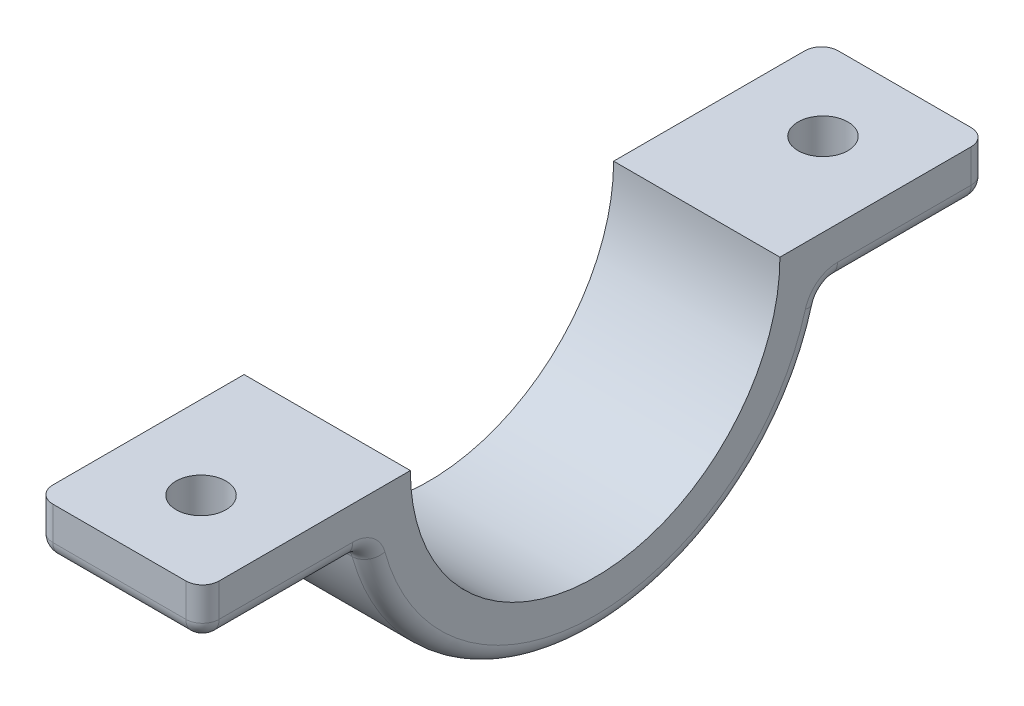
ISO-10303-21;
HEADER;
FILE_DESCRIPTION(('STEP AP214'),'2;1');
FILE_NAME('part.step','',(''),(''),'','','');
FILE_SCHEMA(('AUTOMOTIVE_DESIGN { 1 0 10303 214 1 1 1 1 }'));
ENDSEC;
DATA;
#1=APPLICATION_CONTEXT('core data for automotive mechanical design processes');
#2=APPLICATION_PROTOCOL_DEFINITION('international standard','automotive_design',2000,#1);
#3=PRODUCT_CONTEXT('',#1,'mechanical');
#4=PRODUCT('Part','Part','',(#3));
#5=PRODUCT_RELATED_PRODUCT_CATEGORY('part','',(#4));
#6=PRODUCT_DEFINITION_FORMATION('','',#4);
#7=PRODUCT_DEFINITION_CONTEXT('part definition',#1,'design');
#8=PRODUCT_DEFINITION('design','',#6,#7);
#9=PRODUCT_DEFINITION_SHAPE('','',#8);
#10=(LENGTH_UNIT() NAMED_UNIT(*) SI_UNIT(.MILLI.,.METRE.));
#11=(NAMED_UNIT(*) PLANE_ANGLE_UNIT() SI_UNIT($,.RADIAN.));
#12=(NAMED_UNIT(*) SI_UNIT($,.STERADIAN.) SOLID_ANGLE_UNIT());
#13=UNCERTAINTY_MEASURE_WITH_UNIT(LENGTH_MEASURE(1.E-05),#10,'distance_accuracy_value','');
#14=(GEOMETRIC_REPRESENTATION_CONTEXT(3) GLOBAL_UNCERTAINTY_ASSIGNED_CONTEXT((#13)) GLOBAL_UNIT_ASSIGNED_CONTEXT((#10,
#11,#12)) REPRESENTATION_CONTEXT('',''));
#15=CARTESIAN_POINT('',(0.,0.,0.));
#16=DIRECTION('',(0.,0.,1.));
#17=DIRECTION('',(1.,0.,0.));
#18=AXIS2_PLACEMENT_3D('',#15,#16,#17);
#19=CARTESIAN_POINT('',(10.,0.,0.));
#20=DIRECTION('',(-1.,0.,0.));
#21=DIRECTION('',(0.,0.,1.));
#22=AXIS2_PLACEMENT_3D('',#19,#20,#21);
#23=CYLINDRICAL_SURFACE('',#22,14.1125);
#24=CARTESIAN_POINT('',(0.999999999999999,0.,0.));
#25=DIRECTION('',(1.,0.,0.));
#26=DIRECTION('',(0.,0.,-1.));
#27=AXIS2_PLACEMENT_3D('',#24,#25,#26);
#28=CIRCLE('',#27,14.1125);
#29=CARTESIAN_POINT('',(0.999999999999999,-3.73531844499586,13.6091899966337));
#30=VERTEX_POINT('',#29);
#31=CARTESIAN_POINT('',(0.999999999999999,-3.73531844499586,-13.6091899966337));
#32=VERTEX_POINT('',#31);
#33=EDGE_CURVE('E263',#30,#32,#28,.T.);
#34=ORIENTED_EDGE('',*,*,#33,.T.);
#35=DIRECTION('',(-1.,0.,0.));
#36=VECTOR('',#35,1.);
#37=CARTESIAN_POINT('',(10.,-3.73531844499586,-13.6091899966337));
#38=LINE('',#37,#36);
#39=CARTESIAN_POINT('',(9.,-3.73531844499586,-13.6091899966337));
#40=VERTEX_POINT('',#39);
#41=EDGE_CURVE('E268',#32,#40,#38,.F.);
#42=ORIENTED_EDGE('',*,*,#41,.T.);
#43=CARTESIAN_POINT('',(9.,0.,0.));
#44=DIRECTION('',(1.,0.,0.));
#45=DIRECTION('',(0.,0.,-1.));
#46=AXIS2_PLACEMENT_3D('',#43,#44,#45);
#47=CIRCLE('',#46,14.1125);
#48=CARTESIAN_POINT('',(9.,-3.73531844499586,13.6091899966337));
#49=VERTEX_POINT('',#48);
#50=EDGE_CURVE('E265',#40,#49,#47,.F.);
#51=ORIENTED_EDGE('',*,*,#50,.T.);
#52=DIRECTION('',(-1.,0.,0.));
#53=VECTOR('',#52,1.);
#54=CARTESIAN_POINT('',(10.,-3.73531844499586,13.6091899966337));
#55=LINE('',#54,#53);
#56=EDGE_CURVE('E261',#49,#30,#55,.T.);
#57=ORIENTED_EDGE('',*,*,#56,.T.);
#58=EDGE_LOOP('',(#34,#42,#51,#57));
#59=FACE_BOUND('',#58,.T.);
#60=ADVANCED_FACE('F39',(#59),#23,.T.);
#61=CARTESIAN_POINT('',(10.,-3.,-13.7899476521849));
#62=DIRECTION('',(0.,1.,0.));
#63=DIRECTION('',(0.,0.,1.));
#64=AXIS2_PLACEMENT_3D('',#61,#62,#63);
#65=PLANE('',#64);
#66=DIRECTION('',(0.,0.,-1.));
#67=VECTOR('',#66,1.);
#68=CARTESIAN_POINT('',(0.999999999999999,-3.,-13.7899476521849));
#69=LINE('',#68,#67);
#70=CARTESIAN_POINT('',(0.999999999999999,-3.,-14.5735258688486));
#71=VERTEX_POINT('',#70);
#72=CARTESIAN_POINT('',(0.999999999999999,-3.,-22.6125));
#73=VERTEX_POINT('',#72);
#74=EDGE_CURVE('E238',#71,#73,#69,.T.);
#75=ORIENTED_EDGE('',*,*,#74,.T.);
#76=DIRECTION('',(-1.,0.,0.));
#77=VECTOR('',#76,1.);
#78=CARTESIAN_POINT('',(10.,-3.,-22.6125));
#79=LINE('',#78,#77);
#80=CARTESIAN_POINT('',(9.,-3.,-22.6125));
#81=VERTEX_POINT('',#80);
#82=EDGE_CURVE('E243',#73,#81,#79,.F.);
#83=ORIENTED_EDGE('',*,*,#82,.T.);
#84=DIRECTION('',(0.,0.,-1.));
#85=VECTOR('',#84,1.);
#86=CARTESIAN_POINT('',(9.,-3.,-13.7899476521849));
#87=LINE('',#86,#85);
#88=CARTESIAN_POINT('',(9.,-3.,-14.5735258688486));
#89=VERTEX_POINT('',#88);
#90=EDGE_CURVE('E240',#81,#89,#87,.F.);
#91=ORIENTED_EDGE('',*,*,#90,.T.);
#92=DIRECTION('',(1.,0.,0.));
#93=VECTOR('',#92,1.);
#94=CARTESIAN_POINT('',(0.,-3.,-14.5735258688486));
#95=LINE('',#94,#93);
#96=EDGE_CURVE('E236',#89,#71,#95,.F.);
#97=ORIENTED_EDGE('',*,*,#96,.T.);
#98=EDGE_LOOP('',(#75,#83,#91,#97));
#99=FACE_BOUND('',#98,.T.);
#100=CARTESIAN_POINT('',(5.,-3.,-18.7012238260924));
#101=DIRECTION('',(0.,-1.,0.));
#102=DIRECTION('',(0.,0.,-1.));
#103=AXIS2_PLACEMENT_3D('',#100,#101,#102);
#104=CIRCLE('',#103,1.5);
#105=CARTESIAN_POINT('',(5.,-3.,-20.2012238260924));
#106=VERTEX_POINT('',#105);
#107=EDGE_CURVE('E361',#106,#106,#104,.F.);
#108=ORIENTED_EDGE('',*,*,#107,.T.);
#109=EDGE_LOOP('',(#108));
#110=FACE_BOUND('',#109,.T.);
#111=ADVANCED_FACE('F402',(#99,#110),#65,.F.);
#112=CARTESIAN_POINT('',(10.,0.,-23.6125));
#113=DIRECTION('',(0.,0.,1.));
#114=DIRECTION('',(1.,0.,0.));
#115=AXIS2_PLACEMENT_3D('',#112,#113,#114);
#116=PLANE('',#115);
#117=DIRECTION('',(-1.,0.,0.));
#118=VECTOR('',#117,1.);
#119=CARTESIAN_POINT('',(10.,0.,-23.6125));
#120=LINE('',#119,#118);
#121=CARTESIAN_POINT('',(9.,0.,-23.6125));
#122=VERTEX_POINT('',#121);
#123=CARTESIAN_POINT('',(0.999999999999999,0.,-23.6125));
#124=VERTEX_POINT('',#123);
#125=EDGE_CURVE('E199',#122,#124,#120,.T.);
#126=ORIENTED_EDGE('',*,*,#125,.F.);
#127=DIRECTION('',(0.,1.,0.));
#128=VECTOR('',#127,1.);
#129=CARTESIAN_POINT('',(9.,-3.,-23.6125));
#130=LINE('',#129,#128);
#131=CARTESIAN_POINT('',(9.,-2.,-23.6125));
#132=VERTEX_POINT('',#131);
#133=EDGE_CURVE('E288',#122,#132,#130,.F.);
#134=ORIENTED_EDGE('',*,*,#133,.T.);
#135=DIRECTION('',(-1.,0.,0.));
#136=VECTOR('',#135,1.);
#137=CARTESIAN_POINT('',(10.,-2.,-23.6125));
#138=LINE('',#137,#136);
#139=CARTESIAN_POINT('',(0.999999999999999,-2.,-23.6125));
#140=VERTEX_POINT('',#139);
#141=EDGE_CURVE('E284',#132,#140,#138,.T.);
#142=ORIENTED_EDGE('',*,*,#141,.T.);
#143=DIRECTION('',(0.,1.,0.));
#144=VECTOR('',#143,1.);
#145=CARTESIAN_POINT('',(0.999999999999999,0.,-23.6125));
#146=LINE('',#145,#144);
#147=EDGE_CURVE('E286',#140,#124,#146,.T.);
#148=ORIENTED_EDGE('',*,*,#147,.T.);
#149=EDGE_LOOP('',(#126,#134,#142,#148));
#150=FACE_BOUND('',#149,.T.);
#151=ADVANCED_FACE('F408',(#150),#116,.F.);
#152=CARTESIAN_POINT('',(10.,0.,-11.1125));
#153=DIRECTION('',(0.,-1.,0.));
#154=DIRECTION('',(0.,0.,-1.));
#155=AXIS2_PLACEMENT_3D('',#152,#153,#154);
#156=PLANE('',#155);
#157=CARTESIAN_POINT('',(5.,0.,-18.7012238260924));
#158=DIRECTION('',(0.,-1.,0.));
#159=DIRECTION('',(0.,0.,-1.));
#160=AXIS2_PLACEMENT_3D('',#157,#158,#159);
#161=CIRCLE('',#160,1.5);
#162=CARTESIAN_POINT('',(5.,0.,-20.2012238260924));
#163=VERTEX_POINT('',#162);
#164=EDGE_CURVE('E366',#163,#163,#161,.F.);
#165=ORIENTED_EDGE('',*,*,#164,.F.);
#166=EDGE_LOOP('',(#165));
#167=FACE_BOUND('',#166,.T.);
#168=DIRECTION('',(0.,0.,1.));
#169=VECTOR('',#168,1.);
#170=CARTESIAN_POINT('',(10.,0.,-11.1125));
#171=LINE('',#170,#169);
#172=CARTESIAN_POINT('',(10.,0.,-22.6125));
#173=VERTEX_POINT('',#172);
#174=CARTESIAN_POINT('',(10.,0.,-11.1125));
#175=VERTEX_POINT('',#174);
#176=EDGE_CURVE('E178',#173,#175,#171,.T.);
#177=ORIENTED_EDGE('',*,*,#176,.F.);
#178=CARTESIAN_POINT('',(9.,0.,-22.6125));
#179=DIRECTION('',(0.,-1.,0.));
#180=DIRECTION('',(0.,0.,-1.));
#181=AXIS2_PLACEMENT_3D('',#178,#179,#180);
#182=CIRCLE('',#181,1.);
#183=EDGE_CURVE('E282',#173,#122,#182,.F.);
#184=ORIENTED_EDGE('',*,*,#183,.T.);
#185=ORIENTED_EDGE('',*,*,#125,.T.);
#186=CARTESIAN_POINT('',(0.999999999999999,0.,-22.6125));
#187=DIRECTION('',(0.,-1.,0.));
#188=DIRECTION('',(0.,0.,-1.));
#189=AXIS2_PLACEMENT_3D('',#186,#187,#188);
#190=CIRCLE('',#189,1.);
#191=CARTESIAN_POINT('',(0.,0.,-22.6125));
#192=VERTEX_POINT('',#191);
#193=EDGE_CURVE('E280',#124,#192,#190,.F.);
#194=ORIENTED_EDGE('',*,*,#193,.T.);
#195=DIRECTION('',(0.,0.,1.));
#196=VECTOR('',#195,1.);
#197=CARTESIAN_POINT('',(0.,0.,-11.1125));
#198=LINE('',#197,#196);
#199=CARTESIAN_POINT('',(0.,0.,-11.1125));
#200=VERTEX_POINT('',#199);
#201=EDGE_CURVE('E196',#192,#200,#198,.T.);
#202=ORIENTED_EDGE('',*,*,#201,.T.);
#203=DIRECTION('',(-1.,0.,0.));
#204=VECTOR('',#203,1.);
#205=CARTESIAN_POINT('',(10.,0.,-11.1125));
#206=LINE('',#205,#204);
#207=EDGE_CURVE('E193',#175,#200,#206,.T.);
#208=ORIENTED_EDGE('',*,*,#207,.F.);
#209=EDGE_LOOP('',(#177,#184,#185,#194,#202,#208));
#210=FACE_BOUND('',#209,.T.);
#211=ADVANCED_FACE('F194',(#167,#210),#156,.F.);
#212=CARTESIAN_POINT('',(10.,0.,0.));
#213=DIRECTION('',(-1.,0.,0.));
#214=DIRECTION('',(0.,0.,1.));
#215=AXIS2_PLACEMENT_3D('',#212,#213,#214);
#216=CYLINDRICAL_SURFACE('',#215,11.1125);
#217=CARTESIAN_POINT('',(0.,0.,0.));
#218=DIRECTION('',(-1.,0.,0.));
#219=DIRECTION('',(0.,0.,-1.));
#220=AXIS2_PLACEMENT_3D('',#217,#218,#219);
#221=CIRCLE('',#220,11.1125);
#222=CARTESIAN_POINT('',(0.,0.,11.1125));
#223=VERTEX_POINT('',#222);
#224=EDGE_CURVE('E212',#200,#223,#221,.T.);
#225=ORIENTED_EDGE('',*,*,#224,.T.);
#226=DIRECTION('',(-1.,0.,0.));
#227=VECTOR('',#226,1.);
#228=CARTESIAN_POINT('',(10.,0.,11.1125));
#229=LINE('',#228,#227);
#230=CARTESIAN_POINT('',(10.,0.,11.1125));
#231=VERTEX_POINT('',#230);
#232=EDGE_CURVE('E200',#231,#223,#229,.T.);
#233=ORIENTED_EDGE('',*,*,#232,.F.);
#234=CARTESIAN_POINT('',(10.,0.,0.));
#235=DIRECTION('',(-1.,0.,0.));
#236=DIRECTION('',(0.,0.,-1.));
#237=AXIS2_PLACEMENT_3D('',#234,#235,#236);
#238=CIRCLE('',#237,11.1125);
#239=EDGE_CURVE('E184',#175,#231,#238,.T.);
#240=ORIENTED_EDGE('',*,*,#239,.F.);
#241=ORIENTED_EDGE('',*,*,#207,.T.);
#242=EDGE_LOOP('',(#225,#233,#240,#241));
#243=FACE_BOUND('',#242,.T.);
#244=ADVANCED_FACE('F202',(#243),#216,.F.);
#245=CARTESIAN_POINT('',(10.,0.,23.6125));
#246=DIRECTION('',(0.,-1.,0.));
#247=DIRECTION('',(0.,0.,-1.));
#248=AXIS2_PLACEMENT_3D('',#245,#246,#247);
#249=PLANE('',#248);
#250=CARTESIAN_POINT('',(5.,0.,18.7012238260924));
#251=DIRECTION('',(0.,-1.,0.));
#252=DIRECTION('',(0.,0.,-1.));
#253=AXIS2_PLACEMENT_3D('',#250,#251,#252);
#254=CIRCLE('',#253,1.5);
#255=CARTESIAN_POINT('',(5.,0.,17.2012238260924));
#256=VERTEX_POINT('',#255);
#257=EDGE_CURVE('E213',#256,#256,#254,.T.);
#258=ORIENTED_EDGE('',*,*,#257,.T.);
#259=EDGE_LOOP('',(#258));
#260=FACE_BOUND('',#259,.T.);
#261=DIRECTION('',(0.,0.,1.));
#262=VECTOR('',#261,1.);
#263=CARTESIAN_POINT('',(0.,0.,23.6125));
#264=LINE('',#263,#262);
#265=CARTESIAN_POINT('',(0.,0.,22.6125));
#266=VERTEX_POINT('',#265);
#267=EDGE_CURVE('E190',#223,#266,#264,.T.);
#268=ORIENTED_EDGE('',*,*,#267,.T.);
#269=CARTESIAN_POINT('',(0.999999999999999,0.,22.6125));
#270=DIRECTION('',(0.,-1.,0.));
#271=DIRECTION('',(0.,0.,-1.));
#272=AXIS2_PLACEMENT_3D('',#269,#270,#271);
#273=CIRCLE('',#272,1.);
#274=CARTESIAN_POINT('',(0.999999999999999,0.,23.6125));
#275=VERTEX_POINT('',#274);
#276=EDGE_CURVE('E278',#266,#275,#273,.F.);
#277=ORIENTED_EDGE('',*,*,#276,.T.);
#278=DIRECTION('',(-1.,0.,0.));
#279=VECTOR('',#278,1.);
#280=CARTESIAN_POINT('',(10.,0.,23.6125));
#281=LINE('',#280,#279);
#282=CARTESIAN_POINT('',(9.,0.,23.6125));
#283=VERTEX_POINT('',#282);
#284=EDGE_CURVE('E207',#283,#275,#281,.T.);
#285=ORIENTED_EDGE('',*,*,#284,.F.);
#286=CARTESIAN_POINT('',(9.,0.,22.6125));
#287=DIRECTION('',(0.,-1.,0.));
#288=DIRECTION('',(0.,0.,-1.));
#289=AXIS2_PLACEMENT_3D('',#286,#287,#288);
#290=CIRCLE('',#289,1.);
#291=CARTESIAN_POINT('',(10.,0.,22.6125));
#292=VERTEX_POINT('',#291);
#293=EDGE_CURVE('E276',#283,#292,#290,.F.);
#294=ORIENTED_EDGE('',*,*,#293,.T.);
#295=DIRECTION('',(0.,0.,1.));
#296=VECTOR('',#295,1.);
#297=CARTESIAN_POINT('',(10.,0.,23.6125));
#298=LINE('',#297,#296);
#299=EDGE_CURVE('E205',#231,#292,#298,.T.);
#300=ORIENTED_EDGE('',*,*,#299,.F.);
#301=ORIENTED_EDGE('',*,*,#232,.T.);
#302=EDGE_LOOP('',(#268,#277,#285,#294,#300,#301));
#303=FACE_BOUND('',#302,.T.);
#304=ADVANCED_FACE('F378',(#260,#303),#249,.F.);
#305=CARTESIAN_POINT('',(10.,0.,23.6125));
#306=DIRECTION('',(0.,0.,-1.));
#307=DIRECTION('',(-1.,0.,0.));
#308=AXIS2_PLACEMENT_3D('',#305,#306,#307);
#309=PLANE('',#308);
#310=ORIENTED_EDGE('',*,*,#284,.T.);
#311=DIRECTION('',(0.,-1.,0.));
#312=VECTOR('',#311,1.);
#313=CARTESIAN_POINT('',(0.999999999999999,0.,23.6125));
#314=LINE('',#313,#312);
#315=CARTESIAN_POINT('',(0.999999999999999,-2.,23.6125));
#316=VERTEX_POINT('',#315);
#317=EDGE_CURVE('E274',#275,#316,#314,.T.);
#318=ORIENTED_EDGE('',*,*,#317,.T.);
#319=DIRECTION('',(-1.,0.,0.));
#320=VECTOR('',#319,1.);
#321=CARTESIAN_POINT('',(10.,-2.,23.6125));
#322=LINE('',#321,#320);
#323=CARTESIAN_POINT('',(9.,-2.,23.6125));
#324=VERTEX_POINT('',#323);
#325=EDGE_CURVE('E270',#316,#324,#322,.F.);
#326=ORIENTED_EDGE('',*,*,#325,.T.);
#327=DIRECTION('',(0.,-1.,0.));
#328=VECTOR('',#327,1.);
#329=CARTESIAN_POINT('',(9.,0.,23.6125));
#330=LINE('',#329,#328);
#331=EDGE_CURVE('E272',#324,#283,#330,.F.);
#332=ORIENTED_EDGE('',*,*,#331,.T.);
#333=EDGE_LOOP('',(#310,#318,#326,#332));
#334=FACE_BOUND('',#333,.T.);
#335=ADVANCED_FACE('F391',(#334),#309,.F.);
#336=CARTESIAN_POINT('',(10.,-3.,23.6125));
#337=DIRECTION('',(0.,1.,0.));
#338=DIRECTION('',(0.,0.,1.));
#339=AXIS2_PLACEMENT_3D('',#336,#337,#338);
#340=PLANE('',#339);
#341=DIRECTION('',(0.,0.,-1.));
#342=VECTOR('',#341,1.);
#343=CARTESIAN_POINT('',(0.999999999999999,-3.,23.6125));
#344=LINE('',#343,#342);
#345=CARTESIAN_POINT('',(0.999999999999999,-3.,22.6125));
#346=VERTEX_POINT('',#345);
#347=CARTESIAN_POINT('',(0.999999999999999,-3.,14.5735258688486));
#348=VERTEX_POINT('',#347);
#349=EDGE_CURVE('E290',#346,#348,#344,.T.);
#350=ORIENTED_EDGE('',*,*,#349,.T.);
#351=DIRECTION('',(1.,0.,0.));
#352=VECTOR('',#351,1.);
#353=CARTESIAN_POINT('',(10.,-3.,14.5735258688486));
#354=LINE('',#353,#352);
#355=CARTESIAN_POINT('',(9.,-3.,14.5735258688486));
#356=VERTEX_POINT('',#355);
#357=EDGE_CURVE('E11',#348,#356,#354,.T.);
#358=ORIENTED_EDGE('',*,*,#357,.T.);
#359=DIRECTION('',(0.,0.,-1.));
#360=VECTOR('',#359,1.);
#361=CARTESIAN_POINT('',(9.,-3.,23.6125));
#362=LINE('',#361,#360);
#363=CARTESIAN_POINT('',(9.,-3.,22.6125));
#364=VERTEX_POINT('',#363);
#365=EDGE_CURVE('E48',#356,#364,#362,.F.);
#366=ORIENTED_EDGE('',*,*,#365,.T.);
#367=DIRECTION('',(-1.,0.,0.));
#368=VECTOR('',#367,1.);
#369=CARTESIAN_POINT('',(10.,-3.,22.6125));
#370=LINE('',#369,#368);
#371=EDGE_CURVE('E292',#364,#346,#370,.T.);
#372=ORIENTED_EDGE('',*,*,#371,.T.);
#373=EDGE_LOOP('',(#350,#358,#366,#372));
#374=FACE_BOUND('',#373,.T.);
#375=CARTESIAN_POINT('',(5.,-3.,18.7012238260924));
#376=DIRECTION('',(0.,-1.,0.));
#377=DIRECTION('',(0.,0.,-1.));
#378=AXIS2_PLACEMENT_3D('',#375,#376,#377);
#379=CIRCLE('',#378,1.5);
#380=CARTESIAN_POINT('',(5.,-3.,17.2012238260924));
#381=VERTEX_POINT('',#380);
#382=EDGE_CURVE('E370',#381,#381,#379,.T.);
#383=ORIENTED_EDGE('',*,*,#382,.F.);
#384=EDGE_LOOP('',(#383));
#385=FACE_BOUND('',#384,.T.);
#386=ADVANCED_FACE('F389',(#374,#385),#340,.F.);
#387=CARTESIAN_POINT('',(10.,0.,0.));
#388=DIRECTION('',(1.,0.,0.));
#389=DIRECTION('',(0.,0.,-1.));
#390=AXIS2_PLACEMENT_3D('',#387,#388,#389);
#391=PLANE('',#390);
#392=DIRECTION('',(0.,0.,-1.));
#393=VECTOR('',#392,1.);
#394=CARTESIAN_POINT('',(10.,-2.,-23.6125));
#395=LINE('',#394,#393);
#396=CARTESIAN_POINT('',(10.,-2.,-14.5735258688486));
#397=VERTEX_POINT('',#396);
#398=CARTESIAN_POINT('',(10.,-2.,-22.6125));
#399=VERTEX_POINT('',#398);
#400=EDGE_CURVE('E233',#397,#399,#395,.T.);
#401=ORIENTED_EDGE('',*,*,#400,.T.);
#402=DIRECTION('',(0.,1.,0.));
#403=VECTOR('',#402,1.);
#404=CARTESIAN_POINT('',(10.,0.,-22.6125));
#405=LINE('',#404,#403);
#406=EDGE_CURVE('E187',#399,#173,#405,.T.);
#407=ORIENTED_EDGE('',*,*,#406,.T.);
#408=ORIENTED_EDGE('',*,*,#176,.T.);
#409=ORIENTED_EDGE('',*,*,#239,.T.);
#410=ORIENTED_EDGE('',*,*,#299,.T.);
#411=DIRECTION('',(0.,-1.,0.));
#412=VECTOR('',#411,1.);
#413=CARTESIAN_POINT('',(10.,-3.,22.6125));
#414=LINE('',#413,#412);
#415=CARTESIAN_POINT('',(10.,-2.,22.6125));
#416=VERTEX_POINT('',#415);
#417=EDGE_CURVE('E226',#292,#416,#414,.T.);
#418=ORIENTED_EDGE('',*,*,#417,.T.);
#419=DIRECTION('',(0.,0.,-1.));
#420=VECTOR('',#419,1.);
#421=CARTESIAN_POINT('',(10.,-2.,13.7899476521849));
#422=LINE('',#421,#420);
#423=CARTESIAN_POINT('',(10.,-2.,14.5735258688486));
#424=VERTEX_POINT('',#423);
#425=EDGE_CURVE('E224',#416,#424,#422,.T.);
#426=ORIENTED_EDGE('',*,*,#425,.T.);
#427=CARTESIAN_POINT('',(10.,-4.,14.5735258688486));
#428=DIRECTION('',(1.,0.,0.));
#429=DIRECTION('',(0.,0.,-1.));
#430=AXIS2_PLACEMENT_3D('',#427,#428,#429);
#431=CIRCLE('',#430,2.);
#432=CARTESIAN_POINT('',(10.,-3.47063688999173,12.6448541244187));
#433=VERTEX_POINT('',#432);
#434=EDGE_CURVE('E222',#433,#424,#431,.T.);
#435=ORIENTED_EDGE('',*,*,#434,.F.);
#436=CARTESIAN_POINT('',(10.,0.,0.));
#437=DIRECTION('',(1.,0.,0.));
#438=DIRECTION('',(0.,0.,-1.));
#439=AXIS2_PLACEMENT_3D('',#436,#437,#438);
#440=CIRCLE('',#439,13.1125);
#441=CARTESIAN_POINT('',(10.,-3.47063688999173,-12.6448541244187));
#442=VERTEX_POINT('',#441);
#443=EDGE_CURVE('E228',#433,#442,#440,.T.);
#444=ORIENTED_EDGE('',*,*,#443,.T.);
#445=CARTESIAN_POINT('',(10.,-4.,-14.5735258688486));
#446=DIRECTION('',(1.,0.,0.));
#447=DIRECTION('',(0.,0.,-1.));
#448=AXIS2_PLACEMENT_3D('',#445,#446,#447);
#449=CIRCLE('',#448,2.);
#450=EDGE_CURVE('E230',#397,#442,#449,.T.);
#451=ORIENTED_EDGE('',*,*,#450,.F.);
#452=EDGE_LOOP('',(#401,#407,#408,#409,#410,#418,#426,#435,#444,#451));
#453=FACE_BOUND('',#452,.T.);
#454=ADVANCED_FACE('F181',(#453),#391,.T.);
#455=CARTESIAN_POINT('',(0.,0.,0.));
#456=DIRECTION('',(1.,0.,0.));
#457=DIRECTION('',(0.,0.,-1.));
#458=AXIS2_PLACEMENT_3D('',#455,#456,#457);
#459=PLANE('',#458);
#460=ORIENTED_EDGE('',*,*,#201,.F.);
#461=DIRECTION('',(0.,1.,0.));
#462=VECTOR('',#461,1.);
#463=CARTESIAN_POINT('',(0.,0.,-22.6125));
#464=LINE('',#463,#462);
#465=CARTESIAN_POINT('',(0.,-2.,-22.6125));
#466=VERTEX_POINT('',#465);
#467=EDGE_CURVE('E259',#192,#466,#464,.F.);
#468=ORIENTED_EDGE('',*,*,#467,.T.);
#469=DIRECTION('',(0.,0.,-1.));
#470=VECTOR('',#469,1.);
#471=CARTESIAN_POINT('',(0.,-2.,0.));
#472=LINE('',#471,#470);
#473=CARTESIAN_POINT('',(0.,-2.,-14.5735258688486));
#474=VERTEX_POINT('',#473);
#475=EDGE_CURVE('E257',#466,#474,#472,.F.);
#476=ORIENTED_EDGE('',*,*,#475,.T.);
#477=CARTESIAN_POINT('',(0.,-4.,-14.5735258688486));
#478=DIRECTION('',(1.,0.,0.));
#479=DIRECTION('',(0.,0.,-1.));
#480=AXIS2_PLACEMENT_3D('',#477,#478,#479);
#481=CIRCLE('',#480,2.);
#482=CARTESIAN_POINT('',(0.,-3.47063688999173,-12.6448541244187));
#483=VERTEX_POINT('',#482);
#484=EDGE_CURVE('E254',#483,#474,#481,.F.);
#485=ORIENTED_EDGE('',*,*,#484,.F.);
#486=CARTESIAN_POINT('',(0.,0.,0.));
#487=DIRECTION('',(1.,0.,0.));
#488=DIRECTION('',(0.,0.,-1.));
#489=AXIS2_PLACEMENT_3D('',#486,#487,#488);
#490=CIRCLE('',#489,13.1125);
#491=CARTESIAN_POINT('',(0.,-3.47063688999173,12.6448541244187));
#492=VERTEX_POINT('',#491);
#493=EDGE_CURVE('E252',#483,#492,#490,.F.);
#494=ORIENTED_EDGE('',*,*,#493,.T.);
#495=CARTESIAN_POINT('',(0.,-4.,14.5735258688486));
#496=DIRECTION('',(1.,0.,0.));
#497=DIRECTION('',(0.,0.,-1.));
#498=AXIS2_PLACEMENT_3D('',#495,#496,#497);
#499=CIRCLE('',#498,2.);
#500=CARTESIAN_POINT('',(0.,-2.,14.5735258688486));
#501=VERTEX_POINT('',#500);
#502=EDGE_CURVE('E249',#501,#492,#499,.F.);
#503=ORIENTED_EDGE('',*,*,#502,.F.);
#504=DIRECTION('',(0.,0.,-1.));
#505=VECTOR('',#504,1.);
#506=CARTESIAN_POINT('',(0.,-2.,0.));
#507=LINE('',#506,#505);
#508=CARTESIAN_POINT('',(0.,-2.,22.6125));
#509=VERTEX_POINT('',#508);
#510=EDGE_CURVE('E245',#501,#509,#507,.F.);
#511=ORIENTED_EDGE('',*,*,#510,.T.);
#512=DIRECTION('',(0.,-1.,0.));
#513=VECTOR('',#512,1.);
#514=CARTESIAN_POINT('',(0.,0.,22.6125));
#515=LINE('',#514,#513);
#516=EDGE_CURVE('E247',#509,#266,#515,.F.);
#517=ORIENTED_EDGE('',*,*,#516,.T.);
#518=ORIENTED_EDGE('',*,*,#267,.F.);
#519=ORIENTED_EDGE('',*,*,#224,.F.);
#520=EDGE_LOOP('',(#460,#468,#476,#485,#494,#503,#511,#517,#518,#519));
#521=FACE_BOUND('',#520,.T.);
#522=ADVANCED_FACE('F385',(#521),#459,.F.);
#523=CARTESIAN_POINT('',(5.,0.,18.7012238260924));
#524=DIRECTION('',(0.,-1.,0.));
#525=DIRECTION('',(0.,0.,-1.));
#526=AXIS2_PLACEMENT_3D('',#523,#524,#525);
#527=CYLINDRICAL_SURFACE('',#526,1.5);
#528=ORIENTED_EDGE('',*,*,#257,.F.);
#529=EDGE_LOOP('',(#528));
#530=FACE_BOUND('',#529,.T.);
#531=ORIENTED_EDGE('',*,*,#382,.T.);
#532=EDGE_LOOP('',(#531));
#533=FACE_BOUND('',#532,.T.);
#534=ADVANCED_FACE('F381',(#530,#533),#527,.F.);
#535=CARTESIAN_POINT('',(5.,0.,-18.7012238260924));
#536=DIRECTION('',(0.,-1.,0.));
#537=DIRECTION('',(0.,0.,-1.));
#538=AXIS2_PLACEMENT_3D('',#535,#536,#537);
#539=CYLINDRICAL_SURFACE('',#538,1.5);
#540=ORIENTED_EDGE('',*,*,#164,.T.);
#541=EDGE_LOOP('',(#540));
#542=FACE_BOUND('',#541,.T.);
#543=ORIENTED_EDGE('',*,*,#107,.F.);
#544=EDGE_LOOP('',(#543));
#545=FACE_BOUND('',#544,.T.);
#546=ADVANCED_FACE('F384',(#542,#545),#539,.F.);
#547=CARTESIAN_POINT('',(0.999999999999999,0.,22.6125));
#548=DIRECTION('',(0.,-1.,0.));
#549=DIRECTION('',(0.,0.,-1.));
#550=AXIS2_PLACEMENT_3D('',#547,#548,#549);
#551=CYLINDRICAL_SURFACE('',#550,1.);
#552=CARTESIAN_POINT('',(0.999999999999999,-2.,22.6125));
#553=DIRECTION('',(0.,-1.,0.));
#554=DIRECTION('',(0.,0.,-1.));
#555=AXIS2_PLACEMENT_3D('',#552,#553,#554);
#556=CIRCLE('',#555,1.);
#557=EDGE_CURVE('E43',#316,#509,#556,.T.);
#558=ORIENTED_EDGE('',*,*,#557,.F.);
#559=ORIENTED_EDGE('',*,*,#317,.F.);
#560=ORIENTED_EDGE('',*,*,#276,.F.);
#561=ORIENTED_EDGE('',*,*,#516,.F.);
#562=EDGE_LOOP('',(#558,#559,#560,#561));
#563=FACE_BOUND('',#562,.T.);
#564=ADVANCED_FACE('F41',(#563),#551,.T.);
#565=CARTESIAN_POINT('',(1.,-2.,22.6125));
#566=DIRECTION('',(-1.,0.,0.));
#567=DIRECTION('',(0.,0.,1.));
#568=AXIS2_PLACEMENT_3D('',#565,#566,#567);
#569=SPHERICAL_SURFACE('',#568,1.);
#570=CARTESIAN_POINT('',(0.999999999999999,-2.,22.6125));
#571=DIRECTION('',(-1.,0.,0.));
#572=DIRECTION('',(0.,0.,1.));
#573=AXIS2_PLACEMENT_3D('',#570,#571,#572);
#574=CIRCLE('',#573,1.);
#575=EDGE_CURVE('E352',#316,#346,#574,.F.);
#576=ORIENTED_EDGE('',*,*,#575,.F.);
#577=ORIENTED_EDGE('',*,*,#557,.T.);
#578=CARTESIAN_POINT('',(1.,-2.,22.6125));
#579=DIRECTION('',(0.,0.,1.));
#580=DIRECTION('',(1.,0.,0.));
#581=AXIS2_PLACEMENT_3D('',#578,#579,#580);
#582=CIRCLE('',#581,1.);
#583=EDGE_CURVE('E354',#346,#509,#582,.F.);
#584=ORIENTED_EDGE('',*,*,#583,.F.);
#585=EDGE_LOOP('',(#576,#577,#584));
#586=FACE_BOUND('',#585,.T.);
#587=ADVANCED_FACE('F490',(#586),#569,.T.);
#588=CARTESIAN_POINT('',(0.999999999999999,-2.,23.6125));
#589=DIRECTION('',(0.,0.,-1.));
#590=DIRECTION('',(0.,1.,0.));
#591=AXIS2_PLACEMENT_3D('',#588,#589,#590);
#592=CYLINDRICAL_SURFACE('',#591,1.);
#593=ORIENTED_EDGE('',*,*,#583,.T.);
#594=ORIENTED_EDGE('',*,*,#510,.F.);
#595=CARTESIAN_POINT('',(0.999999999999999,-2.,14.5735258688486));
#596=DIRECTION('',(0.,0.,-1.));
#597=DIRECTION('',(-1.,0.,0.));
#598=AXIS2_PLACEMENT_3D('',#595,#596,#597);
#599=CIRCLE('',#598,1.);
#600=EDGE_CURVE('E349',#348,#501,#599,.T.);
#601=ORIENTED_EDGE('',*,*,#600,.F.);
#602=ORIENTED_EDGE('',*,*,#349,.F.);
#603=EDGE_LOOP('',(#593,#594,#601,#602));
#604=FACE_BOUND('',#603,.T.);
#605=ADVANCED_FACE('F487',(#604),#592,.T.);
#606=CARTESIAN_POINT('',(10.,-2.,22.6125));
#607=DIRECTION('',(-1.,0.,0.));
#608=DIRECTION('',(0.,0.,1.));
#609=AXIS2_PLACEMENT_3D('',#606,#607,#608);
#610=CYLINDRICAL_SURFACE('',#609,1.);
#611=ORIENTED_EDGE('',*,*,#575,.T.);
#612=ORIENTED_EDGE('',*,*,#371,.F.);
#613=CARTESIAN_POINT('',(9.,-2.,22.6125));
#614=DIRECTION('',(1.,0.,0.));
#615=DIRECTION('',(0.,0.,-1.));
#616=AXIS2_PLACEMENT_3D('',#613,#614,#615);
#617=CIRCLE('',#616,1.);
#618=EDGE_CURVE('E346',#324,#364,#617,.T.);
#619=ORIENTED_EDGE('',*,*,#618,.F.);
#620=ORIENTED_EDGE('',*,*,#325,.F.);
#621=EDGE_LOOP('',(#611,#612,#619,#620));
#622=FACE_BOUND('',#621,.T.);
#623=ADVANCED_FACE('F483',(#622),#610,.T.);
#624=CARTESIAN_POINT('',(9.,0.,22.6125));
#625=DIRECTION('',(0.,1.,0.));
#626=DIRECTION('',(0.,0.,1.));
#627=AXIS2_PLACEMENT_3D('',#624,#625,#626);
#628=CYLINDRICAL_SURFACE('',#627,1.);
#629=ORIENTED_EDGE('',*,*,#293,.F.);
#630=ORIENTED_EDGE('',*,*,#331,.F.);
#631=CARTESIAN_POINT('',(9.,-2.,22.6125));
#632=DIRECTION('',(0.,-1.,0.));
#633=DIRECTION('',(0.,0.,-1.));
#634=AXIS2_PLACEMENT_3D('',#631,#632,#633);
#635=CIRCLE('',#634,1.);
#636=EDGE_CURVE('E343',#416,#324,#635,.T.);
#637=ORIENTED_EDGE('',*,*,#636,.F.);
#638=ORIENTED_EDGE('',*,*,#417,.F.);
#639=EDGE_LOOP('',(#629,#630,#637,#638));
#640=FACE_BOUND('',#639,.T.);
#641=ADVANCED_FACE('F479',(#640),#628,.T.);
#642=CARTESIAN_POINT('',(0.999999999999999,-4.,14.5735258688486));
#643=DIRECTION('',(1.,0.,0.));
#644=DIRECTION('',(0.,0.,-1.));
#645=AXIS2_PLACEMENT_3D('',#642,#643,#644);
#646=TOROIDAL_SURFACE('',#645,2.,1.);
#647=ORIENTED_EDGE('',*,*,#600,.T.);
#648=ORIENTED_EDGE('',*,*,#502,.T.);
#649=CARTESIAN_POINT('',(1.,-3.47063688999173,12.6448541244187));
#650=DIRECTION('',(0.,0.964335872214963,0.264681555004136));
#651=DIRECTION('',(0.,-0.264681555004136,0.964335872214963));
#652=AXIS2_PLACEMENT_3D('',#649,#650,#651);
#653=CIRCLE('',#652,1.);
#654=EDGE_CURVE('E340',#30,#492,#653,.F.);
#655=ORIENTED_EDGE('',*,*,#654,.F.);
#656=CARTESIAN_POINT('',(0.999999999999999,-4.,14.5735258688486));
#657=DIRECTION('',(1.,0.,0.));
#658=DIRECTION('',(0.,0.,-1.));
#659=AXIS2_PLACEMENT_3D('',#656,#657,#658);
#660=CIRCLE('',#659,1.);
#661=EDGE_CURVE('E337',#348,#30,#660,.F.);
#662=ORIENTED_EDGE('',*,*,#661,.F.);
#663=EDGE_LOOP('',(#647,#648,#655,#662));
#664=FACE_BOUND('',#663,.T.);
#665=ADVANCED_FACE('F475',(#664),#646,.T.);
#666=CARTESIAN_POINT('',(9.,-2.,22.6125));
#667=DIRECTION('',(0.,0.,1.));
#668=DIRECTION('',(1.,0.,0.));
#669=AXIS2_PLACEMENT_3D('',#666,#667,#668);
#670=SPHERICAL_SURFACE('',#669,1.);
#671=ORIENTED_EDGE('',*,*,#636,.T.);
#672=ORIENTED_EDGE('',*,*,#618,.T.);
#673=CARTESIAN_POINT('',(9.,-2.,22.6125));
#674=DIRECTION('',(0.,0.,1.));
#675=DIRECTION('',(1.,0.,0.));
#676=AXIS2_PLACEMENT_3D('',#673,#674,#675);
#677=CIRCLE('',#676,1.);
#678=EDGE_CURVE('E334',#416,#364,#677,.F.);
#679=ORIENTED_EDGE('',*,*,#678,.F.);
#680=EDGE_LOOP('',(#671,#672,#679));
#681=FACE_BOUND('',#680,.T.);
#682=ADVANCED_FACE('F471',(#681),#670,.T.);
#683=CARTESIAN_POINT('',(0.999999999999999,0.,0.));
#684=DIRECTION('',(1.,0.,0.));
#685=DIRECTION('',(0.,0.,-1.));
#686=AXIS2_PLACEMENT_3D('',#683,#684,#685);
#687=TOROIDAL_SURFACE('',#686,13.1125,1.);
#688=ORIENTED_EDGE('',*,*,#654,.T.);
#689=ORIENTED_EDGE('',*,*,#493,.F.);
#690=CARTESIAN_POINT('',(0.999999999999999,-3.47063688999173,-12.6448541244187));
#691=DIRECTION('',(0.,0.964335872214962,-0.264681555004136));
#692=DIRECTION('',(0.,0.264681555004136,0.964335872214963));
#693=AXIS2_PLACEMENT_3D('',#690,#691,#692);
#694=CIRCLE('',#693,1.);
#695=EDGE_CURVE('E328',#32,#483,#694,.T.);
#696=ORIENTED_EDGE('',*,*,#695,.F.);
#697=ORIENTED_EDGE('',*,*,#33,.F.);
#698=EDGE_LOOP('',(#688,#689,#696,#697));
#699=FACE_BOUND('',#698,.T.);
#700=ADVANCED_FACE('F467',(#699),#687,.T.);
#701=CARTESIAN_POINT('',(10.,-4.,14.5735258688486));
#702=DIRECTION('',(-1.,0.,0.));
#703=DIRECTION('',(0.,0.,1.));
#704=AXIS2_PLACEMENT_3D('',#701,#702,#703);
#705=CYLINDRICAL_SURFACE('',#704,1.);
#706=ORIENTED_EDGE('',*,*,#661,.T.);
#707=ORIENTED_EDGE('',*,*,#56,.F.);
#708=CARTESIAN_POINT('',(9.,-4.,14.5735258688486));
#709=DIRECTION('',(1.,0.,0.));
#710=DIRECTION('',(0.,0.,-1.));
#711=AXIS2_PLACEMENT_3D('',#708,#709,#710);
#712=CIRCLE('',#711,1.);
#713=EDGE_CURVE('E326',#356,#49,#712,.F.);
#714=ORIENTED_EDGE('',*,*,#713,.F.);
#715=ORIENTED_EDGE('',*,*,#357,.F.);
#716=EDGE_LOOP('',(#706,#707,#714,#715));
#717=FACE_BOUND('',#716,.T.);
#718=ADVANCED_FACE('F463',(#717),#705,.F.);
#719=CARTESIAN_POINT('',(9.,-2.,0.));
#720=DIRECTION('',(0.,0.,1.));
#721=DIRECTION('',(0.,-1.,0.));
#722=AXIS2_PLACEMENT_3D('',#719,#720,#721);
#723=CYLINDRICAL_SURFACE('',#722,1.);
#724=ORIENTED_EDGE('',*,*,#678,.T.);
#725=ORIENTED_EDGE('',*,*,#365,.F.);
#726=CARTESIAN_POINT('',(9.,-2.,14.5735258688486));
#727=DIRECTION('',(0.,0.,-1.));
#728=DIRECTION('',(-1.,0.,0.));
#729=AXIS2_PLACEMENT_3D('',#726,#727,#728);
#730=CIRCLE('',#729,1.);
#731=EDGE_CURVE('E56',#424,#356,#730,.T.);
#732=ORIENTED_EDGE('',*,*,#731,.F.);
#733=ORIENTED_EDGE('',*,*,#425,.F.);
#734=EDGE_LOOP('',(#724,#725,#732,#733));
#735=FACE_BOUND('',#734,.T.);
#736=ADVANCED_FACE('F459',(#735),#723,.T.);
#737=CARTESIAN_POINT('',(0.999999999999999,0.,-22.6125));
#738=DIRECTION('',(0.,1.,0.));
#739=DIRECTION('',(0.,0.,1.));
#740=AXIS2_PLACEMENT_3D('',#737,#738,#739);
#741=CYLINDRICAL_SURFACE('',#740,1.);
#742=ORIENTED_EDGE('',*,*,#193,.F.);
#743=ORIENTED_EDGE('',*,*,#147,.F.);
#744=CARTESIAN_POINT('',(1.,-2.,-22.6125));
#745=DIRECTION('',(0.,-1.,0.));
#746=DIRECTION('',(0.,0.,-1.));
#747=AXIS2_PLACEMENT_3D('',#744,#745,#746);
#748=CIRCLE('',#747,1.);
#749=EDGE_CURVE('E322',#466,#140,#748,.T.);
#750=ORIENTED_EDGE('',*,*,#749,.F.);
#751=ORIENTED_EDGE('',*,*,#467,.F.);
#752=EDGE_LOOP('',(#742,#743,#750,#751));
#753=FACE_BOUND('',#752,.T.);
#754=ADVANCED_FACE('F455',(#753),#741,.T.);
#755=CARTESIAN_POINT('',(0.999999999999999,-2.,-13.7899476521849));
#756=DIRECTION('',(0.,0.,-1.));
#757=DIRECTION('',(0.,1.,0.));
#758=AXIS2_PLACEMENT_3D('',#755,#756,#757);
#759=CYLINDRICAL_SURFACE('',#758,1.);
#760=CARTESIAN_POINT('',(1.,-2.,-14.5735258688486));
#761=DIRECTION('',(0.,0.,1.));
#762=DIRECTION('',(1.,0.,0.));
#763=AXIS2_PLACEMENT_3D('',#760,#761,#762);
#764=CIRCLE('',#763,1.);
#765=EDGE_CURVE('E331',#474,#71,#764,.T.);
#766=ORIENTED_EDGE('',*,*,#765,.F.);
#767=ORIENTED_EDGE('',*,*,#475,.F.);
#768=CARTESIAN_POINT('',(0.999999999999999,-2.,-22.6125));
#769=DIRECTION('',(0.,0.,-1.));
#770=DIRECTION('',(-1.,0.,0.));
#771=AXIS2_PLACEMENT_3D('',#768,#769,#770);
#772=CIRCLE('',#771,1.);
#773=EDGE_CURVE('E319',#73,#466,#772,.T.);
#774=ORIENTED_EDGE('',*,*,#773,.F.);
#775=ORIENTED_EDGE('',*,*,#74,.F.);
#776=EDGE_LOOP('',(#766,#767,#774,#775));
#777=FACE_BOUND('',#776,.T.);
#778=ADVANCED_FACE('F451',(#777),#759,.T.);
#779=CARTESIAN_POINT('',(0.999999999999999,-4.,-14.5735258688486));
#780=DIRECTION('',(1.,0.,0.));
#781=DIRECTION('',(0.,0.,-1.));
#782=AXIS2_PLACEMENT_3D('',#779,#780,#781);
#783=TOROIDAL_SURFACE('',#782,2.,1.);
#784=ORIENTED_EDGE('',*,*,#484,.T.);
#785=ORIENTED_EDGE('',*,*,#765,.T.);
#786=CARTESIAN_POINT('',(0.999999999999999,-4.,-14.5735258688486));
#787=DIRECTION('',(1.,0.,0.));
#788=DIRECTION('',(0.,0.,-1.));
#789=AXIS2_PLACEMENT_3D('',#786,#787,#788);
#790=CIRCLE('',#789,1.);
#791=EDGE_CURVE('E316',#32,#71,#790,.F.);
#792=ORIENTED_EDGE('',*,*,#791,.F.);
#793=ORIENTED_EDGE('',*,*,#695,.T.);
#794=EDGE_LOOP('',(#784,#785,#792,#793));
#795=FACE_BOUND('',#794,.T.);
#796=ADVANCED_FACE('F448',(#795),#783,.T.);
#797=CARTESIAN_POINT('',(9.,-4.,14.5735258688486));
#798=DIRECTION('',(1.,0.,0.));
#799=DIRECTION('',(0.,0.,-1.));
#800=AXIS2_PLACEMENT_3D('',#797,#798,#799);
#801=TOROIDAL_SURFACE('',#800,2.,1.);
#802=ORIENTED_EDGE('',*,*,#731,.T.);
#803=ORIENTED_EDGE('',*,*,#713,.T.);
#804=CARTESIAN_POINT('',(9.,-3.47063688999173,12.6448541244187));
#805=DIRECTION('',(0.,0.964335872214962,0.264681555004136));
#806=DIRECTION('',(0.,-0.264681555004136,0.964335872214963));
#807=AXIS2_PLACEMENT_3D('',#804,#805,#806);
#808=CIRCLE('',#807,1.);
#809=EDGE_CURVE('E314',#433,#49,#808,.F.);
#810=ORIENTED_EDGE('',*,*,#809,.F.);
#811=ORIENTED_EDGE('',*,*,#434,.T.);
#812=EDGE_LOOP('',(#802,#803,#810,#811));
#813=FACE_BOUND('',#812,.T.);
#814=ADVANCED_FACE('F444',(#813),#801,.T.);
#815=CARTESIAN_POINT('',(1.,-2.,-22.6125));
#816=DIRECTION('',(-1.,0.,0.));
#817=DIRECTION('',(0.,0.,1.));
#818=AXIS2_PLACEMENT_3D('',#815,#816,#817);
#819=SPHERICAL_SURFACE('',#818,1.);
#820=ORIENTED_EDGE('',*,*,#773,.T.);
#821=ORIENTED_EDGE('',*,*,#749,.T.);
#822=CARTESIAN_POINT('',(0.999999999999999,-2.,-22.6125));
#823=DIRECTION('',(-1.,0.,0.));
#824=DIRECTION('',(0.,0.,1.));
#825=AXIS2_PLACEMENT_3D('',#822,#823,#824);
#826=CIRCLE('',#825,1.);
#827=EDGE_CURVE('E311',#73,#140,#826,.F.);
#828=ORIENTED_EDGE('',*,*,#827,.F.);
#829=EDGE_LOOP('',(#820,#821,#828));
#830=FACE_BOUND('',#829,.T.);
#831=ADVANCED_FACE('F440',(#830),#819,.T.);
#832=CARTESIAN_POINT('',(10.,-4.,-14.5735258688486));
#833=DIRECTION('',(-1.,0.,0.));
#834=DIRECTION('',(0.,0.,1.));
#835=AXIS2_PLACEMENT_3D('',#832,#833,#834);
#836=CYLINDRICAL_SURFACE('',#835,1.);
#837=ORIENTED_EDGE('',*,*,#791,.T.);
#838=ORIENTED_EDGE('',*,*,#96,.F.);
#839=CARTESIAN_POINT('',(9.,-4.,-14.5735258688486));
#840=DIRECTION('',(1.,0.,0.));
#841=DIRECTION('',(0.,0.,-1.));
#842=AXIS2_PLACEMENT_3D('',#839,#840,#841);
#843=CIRCLE('',#842,1.);
#844=EDGE_CURVE('E308',#40,#89,#843,.F.);
#845=ORIENTED_EDGE('',*,*,#844,.F.);
#846=ORIENTED_EDGE('',*,*,#41,.F.);
#847=EDGE_LOOP('',(#837,#838,#845,#846));
#848=FACE_BOUND('',#847,.T.);
#849=ADVANCED_FACE('F436',(#848),#836,.F.);
#850=CARTESIAN_POINT('',(9.,0.,0.));
#851=DIRECTION('',(1.,0.,0.));
#852=DIRECTION('',(0.,0.,-1.));
#853=AXIS2_PLACEMENT_3D('',#850,#851,#852);
#854=TOROIDAL_SURFACE('',#853,13.1125,1.);
#855=ORIENTED_EDGE('',*,*,#809,.T.);
#856=ORIENTED_EDGE('',*,*,#50,.F.);
#857=CARTESIAN_POINT('',(9.,-3.47063688999173,-12.6448541244187));
#858=DIRECTION('',(0.,0.964335872214962,-0.264681555004136));
#859=DIRECTION('',(0.,0.264681555004136,0.964335872214963));
#860=AXIS2_PLACEMENT_3D('',#857,#858,#859);
#861=CIRCLE('',#860,1.);
#862=EDGE_CURVE('E305',#442,#40,#861,.T.);
#863=ORIENTED_EDGE('',*,*,#862,.F.);
#864=ORIENTED_EDGE('',*,*,#443,.F.);
#865=EDGE_LOOP('',(#855,#856,#863,#864));
#866=FACE_BOUND('',#865,.T.);
#867=ADVANCED_FACE('F432',(#866),#854,.T.);
#868=CARTESIAN_POINT('',(9.,0.,-22.6125));
#869=DIRECTION('',(0.,-1.,0.));
#870=DIRECTION('',(0.,0.,-1.));
#871=AXIS2_PLACEMENT_3D('',#868,#869,#870);
#872=CYLINDRICAL_SURFACE('',#871,1.);
#873=ORIENTED_EDGE('',*,*,#183,.F.);
#874=ORIENTED_EDGE('',*,*,#406,.F.);
#875=CARTESIAN_POINT('',(9.,-2.,-22.6125));
#876=DIRECTION('',(0.,-1.,0.));
#877=DIRECTION('',(0.,0.,-1.));
#878=AXIS2_PLACEMENT_3D('',#875,#876,#877);
#879=CIRCLE('',#878,1.);
#880=EDGE_CURVE('E302',#132,#399,#879,.T.);
#881=ORIENTED_EDGE('',*,*,#880,.F.);
#882=ORIENTED_EDGE('',*,*,#133,.F.);
#883=EDGE_LOOP('',(#873,#874,#881,#882));
#884=FACE_BOUND('',#883,.T.);
#885=ADVANCED_FACE('F428',(#884),#872,.T.);
#886=CARTESIAN_POINT('',(10.,-2.,-22.6125));
#887=DIRECTION('',(-1.,0.,0.));
#888=DIRECTION('',(0.,0.,1.));
#889=AXIS2_PLACEMENT_3D('',#886,#887,#888);
#890=CYLINDRICAL_SURFACE('',#889,1.);
#891=ORIENTED_EDGE('',*,*,#827,.T.);
#892=ORIENTED_EDGE('',*,*,#141,.F.);
#893=CARTESIAN_POINT('',(9.,-2.,-22.6125));
#894=DIRECTION('',(1.,0.,0.));
#895=DIRECTION('',(0.,0.,-1.));
#896=AXIS2_PLACEMENT_3D('',#893,#894,#895);
#897=CIRCLE('',#896,1.);
#898=EDGE_CURVE('E299',#81,#132,#897,.T.);
#899=ORIENTED_EDGE('',*,*,#898,.F.);
#900=ORIENTED_EDGE('',*,*,#82,.F.);
#901=EDGE_LOOP('',(#891,#892,#899,#900));
#902=FACE_BOUND('',#901,.T.);
#903=ADVANCED_FACE('F424',(#902),#890,.T.);
#904=CARTESIAN_POINT('',(9.,-4.,-14.5735258688486));
#905=DIRECTION('',(1.,0.,0.));
#906=DIRECTION('',(0.,0.,-1.));
#907=AXIS2_PLACEMENT_3D('',#904,#905,#906);
#908=TOROIDAL_SURFACE('',#907,2.,1.);
#909=ORIENTED_EDGE('',*,*,#862,.T.);
#910=ORIENTED_EDGE('',*,*,#844,.T.);
#911=CARTESIAN_POINT('',(9.,-2.,-14.5735258688486));
#912=DIRECTION('',(0.,0.,1.));
#913=DIRECTION('',(1.,0.,0.));
#914=AXIS2_PLACEMENT_3D('',#911,#912,#913);
#915=CIRCLE('',#914,1.);
#916=EDGE_CURVE('E297',#397,#89,#915,.F.);
#917=ORIENTED_EDGE('',*,*,#916,.F.);
#918=ORIENTED_EDGE('',*,*,#450,.T.);
#919=EDGE_LOOP('',(#909,#910,#917,#918));
#920=FACE_BOUND('',#919,.T.);
#921=ADVANCED_FACE('F420',(#920),#908,.T.);
#922=CARTESIAN_POINT('',(9.,-2.,-22.6125));
#923=DIRECTION('',(0.,0.,-1.));
#924=DIRECTION('',(-1.,0.,0.));
#925=AXIS2_PLACEMENT_3D('',#922,#923,#924);
#926=SPHERICAL_SURFACE('',#925,1.);
#927=ORIENTED_EDGE('',*,*,#898,.T.);
#928=ORIENTED_EDGE('',*,*,#880,.T.);
#929=CARTESIAN_POINT('',(9.,-2.,-22.6125));
#930=DIRECTION('',(0.,0.,-1.));
#931=DIRECTION('',(-1.,0.,0.));
#932=AXIS2_PLACEMENT_3D('',#929,#930,#931);
#933=CIRCLE('',#932,1.);
#934=EDGE_CURVE('E295',#81,#399,#933,.F.);
#935=ORIENTED_EDGE('',*,*,#934,.F.);
#936=EDGE_LOOP('',(#927,#928,#935));
#937=FACE_BOUND('',#936,.T.);
#938=ADVANCED_FACE('F416',(#937),#926,.T.);
#939=CARTESIAN_POINT('',(9.,-2.,0.));
#940=DIRECTION('',(0.,0.,1.));
#941=DIRECTION('',(0.,-1.,0.));
#942=AXIS2_PLACEMENT_3D('',#939,#940,#941);
#943=CYLINDRICAL_SURFACE('',#942,1.);
#944=ORIENTED_EDGE('',*,*,#916,.T.);
#945=ORIENTED_EDGE('',*,*,#90,.F.);
#946=ORIENTED_EDGE('',*,*,#934,.T.);
#947=ORIENTED_EDGE('',*,*,#400,.F.);
#948=EDGE_LOOP('',(#944,#945,#946,#947));
#949=FACE_BOUND('',#948,.T.);
#950=ADVANCED_FACE('F413',(#949),#943,.T.);
#951=CLOSED_SHELL('',(#60,#111,#151,#211,#244,#304,#335,#386,#454,#522,#534,#546,#564,#587,#605,
#623,#641,#665,#682,#700,#718,#736,#754,#778,#796,#814,#831,#849,#867,#885,#903,#921,#938,#950));
#952=MANIFOLD_SOLID_BREP('B2',#951);
#953=ADVANCED_BREP_SHAPE_REPRESENTATION('',(#18,#952),#14);
#954=SHAPE_DEFINITION_REPRESENTATION(#9,#953);
ENDSEC;
END-ISO-10303-21;
